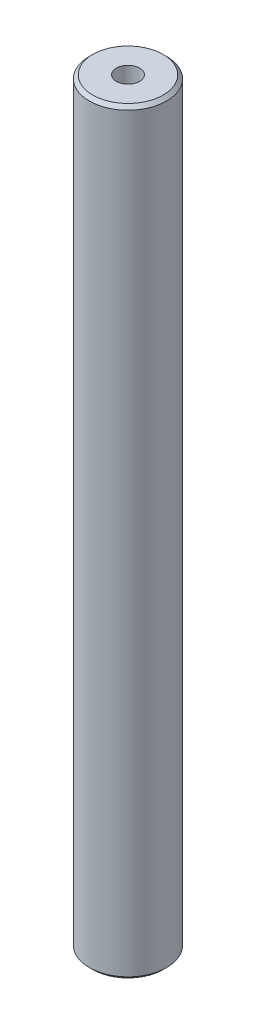
ISO-10303-21;
HEADER;
FILE_DESCRIPTION(('STEP AP214'),'2;1');
FILE_NAME('part.step','',(''),(''),'','','');
FILE_SCHEMA(('AUTOMOTIVE_DESIGN { 1 0 10303 214 1 1 1 1 }'));
ENDSEC;
DATA;
#1=APPLICATION_CONTEXT('core data for automotive mechanical design processes');
#2=APPLICATION_PROTOCOL_DEFINITION('international standard','automotive_design',2000,#1);
#3=PRODUCT_CONTEXT('',#1,'mechanical');
#4=PRODUCT('Part','Part','',(#3));
#5=PRODUCT_RELATED_PRODUCT_CATEGORY('part','',(#4));
#6=PRODUCT_DEFINITION_FORMATION('','',#4);
#7=PRODUCT_DEFINITION_CONTEXT('part definition',#1,'design');
#8=PRODUCT_DEFINITION('design','',#6,#7);
#9=PRODUCT_DEFINITION_SHAPE('','',#8);
#10=(LENGTH_UNIT() NAMED_UNIT(*) SI_UNIT(.MILLI.,.METRE.));
#11=(NAMED_UNIT(*) PLANE_ANGLE_UNIT() SI_UNIT($,.RADIAN.));
#12=(NAMED_UNIT(*) SI_UNIT($,.STERADIAN.) SOLID_ANGLE_UNIT());
#13=UNCERTAINTY_MEASURE_WITH_UNIT(LENGTH_MEASURE(1.E-05),#10,'distance_accuracy_value','');
#14=(GEOMETRIC_REPRESENTATION_CONTEXT(3) GLOBAL_UNCERTAINTY_ASSIGNED_CONTEXT((#13)) GLOBAL_UNIT_ASSIGNED_CONTEXT((#10,
#11,#12)) REPRESENTATION_CONTEXT('',''));
#15=CARTESIAN_POINT('',(0.,0.,0.));
#16=DIRECTION('',(0.,0.,1.));
#17=DIRECTION('',(1.,0.,0.));
#18=AXIS2_PLACEMENT_3D('',#15,#16,#17);
#19=CARTESIAN_POINT('',(0.,343.058098373891,0.));
#20=DIRECTION('',(0.,-1.,0.));
#21=DIRECTION('',(0.,0.,-1.));
#22=AXIS2_PLACEMENT_3D('',#19,#20,#21);
#23=CYLINDRICAL_SURFACE('',#22,17.5);
#24=CARTESIAN_POINT('',(0.,341.503571788543,0.));
#25=DIRECTION('',(0.,1.,0.));
#26=DIRECTION('',(0.,0.,1.));
#27=AXIS2_PLACEMENT_3D('',#24,#25,#26);
#28=CIRCLE('',#27,17.5);
#29=CARTESIAN_POINT('',(0.,341.503571788543,17.5));
#30=VERTEX_POINT('',#29);
#31=EDGE_CURVE('E50',#30,#30,#28,.F.);
#32=ORIENTED_EDGE('',*,*,#31,.T.);
#33=EDGE_LOOP('',(#32));
#34=FACE_BOUND('',#33,.T.);
#35=CARTESIAN_POINT('',(0.,1.55452658534833,0.));
#36=DIRECTION('',(0.,1.,0.));
#37=DIRECTION('',(0.,0.,1.));
#38=AXIS2_PLACEMENT_3D('',#35,#36,#37);
#39=CIRCLE('',#38,17.5);
#40=CARTESIAN_POINT('',(0.,1.55452658534833,17.5));
#41=VERTEX_POINT('',#40);
#42=EDGE_CURVE('E51',#41,#41,#39,.T.);
#43=ORIENTED_EDGE('',*,*,#42,.T.);
#44=EDGE_LOOP('',(#43));
#45=FACE_BOUND('',#44,.T.);
#46=ADVANCED_FACE('F39',(#34,#45),#23,.T.);
#47=CARTESIAN_POINT('',(0.,343.058098373891,0.));
#48=DIRECTION('',(0.,1.,0.));
#49=DIRECTION('',(0.,0.,1.));
#50=AXIS2_PLACEMENT_3D('',#47,#48,#49);
#51=PLANE('',#50);
#52=CARTESIAN_POINT('',(0.,343.058098373891,0.));
#53=DIRECTION('',(0.,1.,0.));
#54=DIRECTION('',(0.,0.,1.));
#55=AXIS2_PLACEMENT_3D('',#52,#53,#54);
#56=CIRCLE('',#55,15.9454734146517);
#57=CARTESIAN_POINT('',(0.,343.058098373891,15.9454734146517));
#58=VERTEX_POINT('',#57);
#59=EDGE_CURVE('E54',#58,#58,#56,.T.);
#60=ORIENTED_EDGE('',*,*,#59,.T.);
#61=EDGE_LOOP('',(#60));
#62=FACE_BOUND('',#61,.T.);
#63=CARTESIAN_POINT('',(0.,343.058098373891,0.));
#64=DIRECTION('',(0.,1.,0.));
#65=DIRECTION('',(0.,0.,1.));
#66=AXIS2_PLACEMENT_3D('',#63,#64,#65);
#67=CIRCLE('',#66,5.25180682377892);
#68=CARTESIAN_POINT('',(0.,343.058098373891,5.25180682377892));
#69=VERTEX_POINT('',#68);
#70=EDGE_CURVE('E58',#69,#69,#67,.T.);
#71=ORIENTED_EDGE('',*,*,#70,.F.);
#72=EDGE_LOOP('',(#71));
#73=FACE_BOUND('',#72,.T.);
#74=ADVANCED_FACE('F69',(#62,#73),#51,.T.);
#75=CARTESIAN_POINT('',(0.,0.,0.));
#76=DIRECTION('',(0.,1.,0.));
#77=DIRECTION('',(0.,0.,1.));
#78=AXIS2_PLACEMENT_3D('',#75,#76,#77);
#79=PLANE('',#78);
#80=CARTESIAN_POINT('',(0.,0.,0.));
#81=DIRECTION('',(0.,1.,0.));
#82=DIRECTION('',(0.,0.,1.));
#83=AXIS2_PLACEMENT_3D('',#80,#81,#82);
#84=CIRCLE('',#83,15.9454734146517);
#85=CARTESIAN_POINT('',(0.,0.,15.9454734146517));
#86=VERTEX_POINT('',#85);
#87=EDGE_CURVE('E10',#86,#86,#84,.F.);
#88=ORIENTED_EDGE('',*,*,#87,.T.);
#89=EDGE_LOOP('',(#88));
#90=FACE_BOUND('',#89,.T.);
#91=CARTESIAN_POINT('',(0.,0.,0.));
#92=DIRECTION('',(0.,1.,0.));
#93=DIRECTION('',(0.,0.,1.));
#94=AXIS2_PLACEMENT_3D('',#91,#92,#93);
#95=CIRCLE('',#94,5.25180682377892);
#96=CARTESIAN_POINT('',(0.,0.,5.25180682377892));
#97=VERTEX_POINT('',#96);
#98=EDGE_CURVE('E63',#97,#97,#95,.T.);
#99=ORIENTED_EDGE('',*,*,#98,.T.);
#100=EDGE_LOOP('',(#99));
#101=FACE_BOUND('',#100,.T.);
#102=ADVANCED_FACE('F75',(#90,#101),#79,.F.);
#103=CARTESIAN_POINT('',(0.,343.058098373891,0.));
#104=DIRECTION('',(0.,-1.,0.));
#105=DIRECTION('',(0.,0.,-1.));
#106=AXIS2_PLACEMENT_3D('',#103,#104,#105);
#107=CYLINDRICAL_SURFACE('',#106,5.25180682377892);
#108=ORIENTED_EDGE('',*,*,#70,.T.);
#109=EDGE_LOOP('',(#108));
#110=FACE_BOUND('',#109,.T.);
#111=ORIENTED_EDGE('',*,*,#98,.F.);
#112=EDGE_LOOP('',(#111));
#113=FACE_BOUND('',#112,.T.);
#114=ADVANCED_FACE('F70',(#110,#113),#107,.F.);
#115=CARTESIAN_POINT('',(0.,343.058098373891,0.));
#116=DIRECTION('',(0.,-1.,0.));
#117=DIRECTION('',(0.,0.,-1.));
#118=AXIS2_PLACEMENT_3D('',#115,#116,#117);
#119=CONICAL_SURFACE('',#118,15.9454734146517,0.785398163397427);
#120=ORIENTED_EDGE('',*,*,#31,.F.);
#121=EDGE_LOOP('',(#120));
#122=FACE_BOUND('',#121,.T.);
#123=ORIENTED_EDGE('',*,*,#59,.F.);
#124=EDGE_LOOP('',(#123));
#125=FACE_BOUND('',#124,.T.);
#126=ADVANCED_FACE('F81',(#122,#125),#119,.T.);
#127=CARTESIAN_POINT('',(0.,1.55452658534833,0.));
#128=DIRECTION('',(0.,1.,0.));
#129=DIRECTION('',(0.,0.,1.));
#130=AXIS2_PLACEMENT_3D('',#127,#128,#129);
#131=CONICAL_SURFACE('',#130,17.5,0.785398163397454);
#132=ORIENTED_EDGE('',*,*,#87,.F.);
#133=EDGE_LOOP('',(#132));
#134=FACE_BOUND('',#133,.T.);
#135=ORIENTED_EDGE('',*,*,#42,.F.);
#136=EDGE_LOOP('',(#135));
#137=FACE_BOUND('',#136,.T.);
#138=ADVANCED_FACE('F45',(#134,#137),#131,.T.);
#139=CLOSED_SHELL('',(#46,#74,#102,#114,#126,#138));
#140=MANIFOLD_SOLID_BREP('B2',#139);
#141=ADVANCED_BREP_SHAPE_REPRESENTATION('',(#18,#140),#14);
#142=SHAPE_DEFINITION_REPRESENTATION(#9,#141);
ENDSEC;
END-ISO-10303-21;
